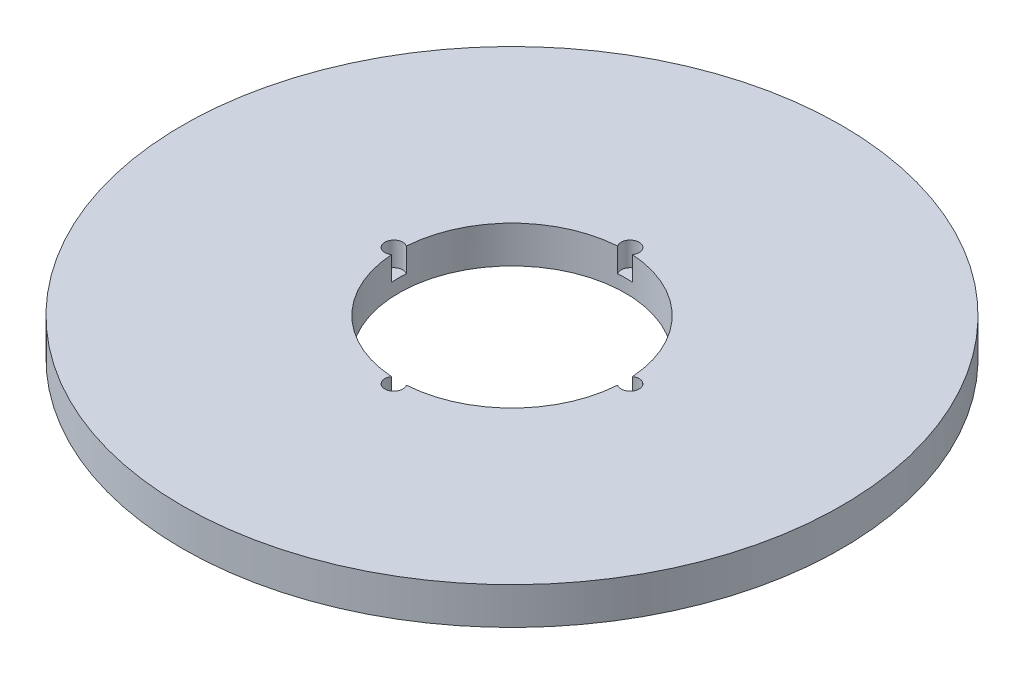
ISO-10303-21;
HEADER;
FILE_DESCRIPTION(('STEP AP214'),'2;1');
FILE_NAME('part.step','',(''),(''),'','','');
FILE_SCHEMA(('AUTOMOTIVE_DESIGN { 1 0 10303 214 1 1 1 1 }'));
ENDSEC;
DATA;
#1=APPLICATION_CONTEXT('core data for automotive mechanical design processes');
#2=APPLICATION_PROTOCOL_DEFINITION('international standard','automotive_design',2000,#1);
#3=PRODUCT_CONTEXT('',#1,'mechanical');
#4=PRODUCT('Part','Part','',(#3));
#5=PRODUCT_RELATED_PRODUCT_CATEGORY('part','',(#4));
#6=PRODUCT_DEFINITION_FORMATION('','',#4);
#7=PRODUCT_DEFINITION_CONTEXT('part definition',#1,'design');
#8=PRODUCT_DEFINITION('design','',#6,#7);
#9=PRODUCT_DEFINITION_SHAPE('','',#8);
#10=(LENGTH_UNIT() NAMED_UNIT(*) SI_UNIT(.MILLI.,.METRE.));
#11=(NAMED_UNIT(*) PLANE_ANGLE_UNIT() SI_UNIT($,.RADIAN.));
#12=(NAMED_UNIT(*) SI_UNIT($,.STERADIAN.) SOLID_ANGLE_UNIT());
#13=UNCERTAINTY_MEASURE_WITH_UNIT(LENGTH_MEASURE(1.E-05),#10,'distance_accuracy_value','');
#14=(GEOMETRIC_REPRESENTATION_CONTEXT(3) GLOBAL_UNCERTAINTY_ASSIGNED_CONTEXT((#13)) GLOBAL_UNIT_ASSIGNED_CONTEXT((#10,
#11,#12)) REPRESENTATION_CONTEXT('',''));
#15=CARTESIAN_POINT('',(0.,0.,0.));
#16=DIRECTION('',(0.,0.,1.));
#17=DIRECTION('',(1.,0.,0.));
#18=AXIS2_PLACEMENT_3D('',#15,#16,#17);
#19=CARTESIAN_POINT('',(0.,9.,0.));
#20=DIRECTION('',(0.,-1.,0.));
#21=DIRECTION('',(0.,0.,-1.));
#22=AXIS2_PLACEMENT_3D('',#19,#20,#21);
#23=CYLINDRICAL_SURFACE('',#22,80.);
#24=CARTESIAN_POINT('',(0.,9.,0.));
#25=DIRECTION('',(0.,1.,0.));
#26=DIRECTION('',(0.,0.,1.));
#27=AXIS2_PLACEMENT_3D('',#24,#25,#26);
#28=CIRCLE('',#27,80.);
#29=CARTESIAN_POINT('',(0.,9.,80.));
#30=VERTEX_POINT('',#29);
#31=EDGE_CURVE('E145',#30,#30,#28,.T.);
#32=ORIENTED_EDGE('',*,*,#31,.F.);
#33=EDGE_LOOP('',(#32));
#34=FACE_BOUND('',#33,.T.);
#35=CARTESIAN_POINT('',(0.,0.,0.));
#36=DIRECTION('',(0.,1.,0.));
#37=DIRECTION('',(0.,0.,1.));
#38=AXIS2_PLACEMENT_3D('',#35,#36,#37);
#39=CIRCLE('',#38,80.);
#40=CARTESIAN_POINT('',(0.,0.,80.));
#41=VERTEX_POINT('',#40);
#42=EDGE_CURVE('E143',#41,#41,#39,.T.);
#43=ORIENTED_EDGE('',*,*,#42,.T.);
#44=EDGE_LOOP('',(#43));
#45=FACE_BOUND('',#44,.T.);
#46=ADVANCED_FACE('F39',(#34,#45),#23,.T.);
#47=CARTESIAN_POINT('',(0.,9.,0.));
#48=DIRECTION('',(0.,1.,0.));
#49=DIRECTION('',(0.,0.,1.));
#50=AXIS2_PLACEMENT_3D('',#47,#48,#49);
#51=PLANE('',#50);
#52=CARTESIAN_POINT('',(1.00161033737131E-13,9.,28.6872602247155));
#53=DIRECTION('',(0.,1.,0.));
#54=DIRECTION('',(1.,0.,0.));
#55=AXIS2_PLACEMENT_3D('',#52,#53,#54);
#56=CIRCLE('',#55,2.18087262641487);
#57=CARTESIAN_POINT('',(-1.79017094720718,9.,27.4416706484823));
#58=VERTEX_POINT('',#57);
#59=CARTESIAN_POINT('',(1.79017094720737,9.,27.4416706484823));
#60=VERTEX_POINT('',#59);
#61=EDGE_CURVE('E152',#58,#60,#56,.T.);
#62=ORIENTED_EDGE('',*,*,#61,.F.);
#63=CARTESIAN_POINT('',(0.,9.,0.));
#64=DIRECTION('',(0.,1.,0.));
#65=DIRECTION('',(0.,0.,1.));
#66=AXIS2_PLACEMENT_3D('',#63,#64,#65);
#67=CIRCLE('',#66,27.5);
#68=CARTESIAN_POINT('',(-27.4416706484823,9.,1.79017094720727));
#69=VERTEX_POINT('',#68);
#70=EDGE_CURVE('E133',#69,#58,#67,.T.);
#71=ORIENTED_EDGE('',*,*,#70,.F.);
#72=CARTESIAN_POINT('',(-28.6872602247155,9.,0.));
#73=DIRECTION('',(0.,1.,0.));
#74=DIRECTION('',(0.,0.,1.));
#75=AXIS2_PLACEMENT_3D('',#72,#73,#74);
#76=CIRCLE('',#75,2.18087262641487);
#77=CARTESIAN_POINT('',(-27.4416706484823,9.,-1.79017094720727));
#78=VERTEX_POINT('',#77);
#79=EDGE_CURVE('E128',#78,#69,#76,.T.);
#80=ORIENTED_EDGE('',*,*,#79,.F.);
#81=CARTESIAN_POINT('',(-1.79017094720756,9.,-27.4416706484823));
#82=VERTEX_POINT('',#81);
#83=EDGE_CURVE('E121',#82,#78,#67,.T.);
#84=ORIENTED_EDGE('',*,*,#83,.F.);
#85=CARTESIAN_POINT('',(-3.00483101211393E-13,9.,-28.6872602247155));
#86=DIRECTION('',(0.,1.,0.));
#87=DIRECTION('',(-1.,0.,0.));
#88=AXIS2_PLACEMENT_3D('',#85,#86,#87);
#89=CIRCLE('',#88,2.18087262641487);
#90=CARTESIAN_POINT('',(1.79017094720698,9.,-27.4416706484823));
#91=VERTEX_POINT('',#90);
#92=EDGE_CURVE('E105',#91,#82,#89,.T.);
#93=ORIENTED_EDGE('',*,*,#92,.F.);
#94=CARTESIAN_POINT('',(27.4416706484823,9.,-1.79017094720727));
#95=VERTEX_POINT('',#94);
#96=EDGE_CURVE('E131',#95,#91,#67,.T.);
#97=ORIENTED_EDGE('',*,*,#96,.F.);
#98=CARTESIAN_POINT('',(28.6872602247155,9.,0.));
#99=DIRECTION('',(0.,1.,0.));
#100=DIRECTION('',(0.,0.,-1.));
#101=AXIS2_PLACEMENT_3D('',#98,#99,#100);
#102=CIRCLE('',#101,2.18087262641487);
#103=CARTESIAN_POINT('',(27.4416706484823,9.,1.79017094720727));
#104=VERTEX_POINT('',#103);
#105=EDGE_CURVE('E154',#104,#95,#102,.T.);
#106=ORIENTED_EDGE('',*,*,#105,.F.);
#107=EDGE_CURVE('E134',#60,#104,#67,.T.);
#108=ORIENTED_EDGE('',*,*,#107,.F.);
#109=EDGE_LOOP('',(#62,#71,#80,#84,#93,#97,#106,#108));
#110=FACE_BOUND('',#109,.T.);
#111=ORIENTED_EDGE('',*,*,#31,.T.);
#112=EDGE_LOOP('',(#111));
#113=FACE_BOUND('',#112,.T.);
#114=ADVANCED_FACE('F130',(#110,#113),#51,.T.);
#115=CARTESIAN_POINT('',(0.,0.,0.));
#116=DIRECTION('',(0.,1.,0.));
#117=DIRECTION('',(0.,0.,1.));
#118=AXIS2_PLACEMENT_3D('',#115,#116,#117);
#119=PLANE('',#118);
#120=CARTESIAN_POINT('',(0.,0.,0.));
#121=DIRECTION('',(0.,1.,0.));
#122=DIRECTION('',(0.,0.,1.));
#123=AXIS2_PLACEMENT_3D('',#120,#121,#122);
#124=CIRCLE('',#123,27.5);
#125=CARTESIAN_POINT('',(0.,0.,27.5));
#126=VERTEX_POINT('',#125);
#127=EDGE_CURVE('E135',#126,#126,#124,.T.);
#128=ORIENTED_EDGE('',*,*,#127,.T.);
#129=EDGE_LOOP('',(#128));
#130=FACE_BOUND('',#129,.T.);
#131=ORIENTED_EDGE('',*,*,#42,.F.);
#132=EDGE_LOOP('',(#131));
#133=FACE_BOUND('',#132,.T.);
#134=ADVANCED_FACE('F195',(#130,#133),#119,.F.);
#135=CARTESIAN_POINT('',(0.,9.,0.));
#136=DIRECTION('',(0.,-1.,0.));
#137=DIRECTION('',(0.,0.,-1.));
#138=AXIS2_PLACEMENT_3D('',#135,#136,#137);
#139=CYLINDRICAL_SURFACE('',#138,27.5);
#140=DIRECTION('',(0.,1.,0.));
#141=VECTOR('',#140,1.);
#142=CARTESIAN_POINT('',(-1.79017094720717,6.0909421968637,27.4416706484823));
#143=LINE('',#142,#141);
#144=CARTESIAN_POINT('',(-1.79017094720718,3.18188439372741,27.4416706484823));
#145=VERTEX_POINT('',#144);
#146=EDGE_CURVE('E11',#145,#58,#143,.T.);
#147=ORIENTED_EDGE('',*,*,#146,.F.);
#148=CARTESIAN_POINT('',(0.,3.18188439372741,0.));
#149=DIRECTION('',(0.,1.,0.));
#150=DIRECTION('',(0.,0.,1.));
#151=AXIS2_PLACEMENT_3D('',#148,#149,#150);
#152=CIRCLE('',#151,27.5);
#153=CARTESIAN_POINT('',(1.79017094720737,3.18188439372741,27.4416706484823));
#154=VERTEX_POINT('',#153);
#155=EDGE_CURVE('E169',#145,#154,#152,.T.);
#156=ORIENTED_EDGE('',*,*,#155,.T.);
#157=DIRECTION('',(0.,1.,0.));
#158=VECTOR('',#157,1.);
#159=CARTESIAN_POINT('',(1.79017094720736,6.0909421968637,27.4416706484823));
#160=LINE('',#159,#158);
#161=EDGE_CURVE('E46',#60,#154,#160,.F.);
#162=ORIENTED_EDGE('',*,*,#161,.F.);
#163=ORIENTED_EDGE('',*,*,#107,.T.);
#164=DIRECTION('',(0.,1.,0.));
#165=VECTOR('',#164,1.);
#166=CARTESIAN_POINT('',(27.4416706484823,6.0909421968637,1.79017094720727));
#167=LINE('',#166,#165);
#168=CARTESIAN_POINT('',(27.4416706484823,3.18188439372741,1.79017094720727));
#169=VERTEX_POINT('',#168);
#170=EDGE_CURVE('E151',#169,#104,#167,.T.);
#171=ORIENTED_EDGE('',*,*,#170,.F.);
#172=CARTESIAN_POINT('',(0.,3.18188439372741,0.));
#173=DIRECTION('',(0.,1.,0.));
#174=DIRECTION('',(0.,0.,1.));
#175=AXIS2_PLACEMENT_3D('',#172,#173,#174);
#176=CIRCLE('',#175,27.5);
#177=CARTESIAN_POINT('',(27.4416706484823,3.18188439372741,-1.79017094720727));
#178=VERTEX_POINT('',#177);
#179=EDGE_CURVE('E173',#169,#178,#176,.T.);
#180=ORIENTED_EDGE('',*,*,#179,.T.);
#181=DIRECTION('',(0.,1.,0.));
#182=VECTOR('',#181,1.);
#183=CARTESIAN_POINT('',(27.4416706484823,6.0909421968637,-1.79017094720727));
#184=LINE('',#183,#182);
#185=EDGE_CURVE('E168',#95,#178,#184,.F.);
#186=ORIENTED_EDGE('',*,*,#185,.F.);
#187=ORIENTED_EDGE('',*,*,#96,.T.);
#188=DIRECTION('',(0.,1.,0.));
#189=VECTOR('',#188,1.);
#190=CARTESIAN_POINT('',(1.79017094720698,6.0909421968637,-27.4416706484823));
#191=LINE('',#190,#189);
#192=CARTESIAN_POINT('',(1.79017094720698,3.18188439372741,-27.4416706484823));
#193=VERTEX_POINT('',#192);
#194=EDGE_CURVE('E108',#193,#91,#191,.T.);
#195=ORIENTED_EDGE('',*,*,#194,.F.);
#196=CARTESIAN_POINT('',(0.,3.18188439372741,0.));
#197=DIRECTION('',(0.,1.,0.));
#198=DIRECTION('',(0.,0.,1.));
#199=AXIS2_PLACEMENT_3D('',#196,#197,#198);
#200=CIRCLE('',#199,27.5);
#201=CARTESIAN_POINT('',(-1.79017094720756,3.18188439372741,-27.4416706484823));
#202=VERTEX_POINT('',#201);
#203=EDGE_CURVE('E122',#193,#202,#200,.T.);
#204=ORIENTED_EDGE('',*,*,#203,.T.);
#205=DIRECTION('',(0.,1.,0.));
#206=VECTOR('',#205,1.);
#207=CARTESIAN_POINT('',(-1.79017094720756,6.0909421968637,-27.4416706484823));
#208=LINE('',#207,#206);
#209=EDGE_CURVE('E106',#82,#202,#208,.F.);
#210=ORIENTED_EDGE('',*,*,#209,.F.);
#211=ORIENTED_EDGE('',*,*,#83,.T.);
#212=DIRECTION('',(0.,1.,0.));
#213=VECTOR('',#212,1.);
#214=CARTESIAN_POINT('',(-27.4416706484823,6.0909421968637,-1.79017094720727));
#215=LINE('',#214,#213);
#216=CARTESIAN_POINT('',(-27.4416706484823,3.18188439372741,-1.79017094720727));
#217=VERTEX_POINT('',#216);
#218=EDGE_CURVE('E177',#217,#78,#215,.T.);
#219=ORIENTED_EDGE('',*,*,#218,.F.);
#220=CARTESIAN_POINT('',(0.,3.18188439372741,0.));
#221=DIRECTION('',(0.,1.,0.));
#222=DIRECTION('',(0.,0.,1.));
#223=AXIS2_PLACEMENT_3D('',#220,#221,#222);
#224=CIRCLE('',#223,27.5);
#225=CARTESIAN_POINT('',(-27.4416706484823,3.18188439372741,1.79017094720727));
#226=VERTEX_POINT('',#225);
#227=EDGE_CURVE('E185',#217,#226,#224,.T.);
#228=ORIENTED_EDGE('',*,*,#227,.T.);
#229=DIRECTION('',(0.,1.,0.));
#230=VECTOR('',#229,1.);
#231=CARTESIAN_POINT('',(-27.4416706484823,6.0909421968637,1.79017094720727));
#232=LINE('',#231,#230);
#233=EDGE_CURVE('E179',#69,#226,#232,.F.);
#234=ORIENTED_EDGE('',*,*,#233,.F.);
#235=ORIENTED_EDGE('',*,*,#70,.T.);
#236=EDGE_LOOP('',(#147,#156,#162,#163,#171,#180,#186,#187,#195,#204,#210,#211,#219,#228,#234,#235));
#237=FACE_BOUND('',#236,.T.);
#238=ORIENTED_EDGE('',*,*,#127,.F.);
#239=EDGE_LOOP('',(#238));
#240=FACE_BOUND('',#239,.T.);
#241=ADVANCED_FACE('F117',(#237,#240),#139,.F.);
#242=CARTESIAN_POINT('',(-28.6872602247155,3.18188439372741,0.));
#243=DIRECTION('',(0.,1.,0.));
#244=DIRECTION('',(0.,0.,1.));
#245=AXIS2_PLACEMENT_3D('',#242,#243,#244);
#246=CYLINDRICAL_SURFACE('',#245,2.18087262641487);
#247=ORIENTED_EDGE('',*,*,#218,.T.);
#248=ORIENTED_EDGE('',*,*,#79,.T.);
#249=ORIENTED_EDGE('',*,*,#233,.T.);
#250=CARTESIAN_POINT('',(-28.6872602247155,3.18188439372741,0.));
#251=DIRECTION('',(0.,1.,0.));
#252=DIRECTION('',(0.,0.,1.));
#253=AXIS2_PLACEMENT_3D('',#250,#251,#252);
#254=CIRCLE('',#253,2.18087262641487);
#255=EDGE_CURVE('E140',#217,#226,#254,.T.);
#256=ORIENTED_EDGE('',*,*,#255,.F.);
#257=EDGE_LOOP('',(#247,#248,#249,#256));
#258=FACE_BOUND('',#257,.T.);
#259=ADVANCED_FACE('F200',(#258),#246,.F.);
#260=CARTESIAN_POINT('',(-28.6872602247155,3.18188439372741,0.));
#261=DIRECTION('',(0.,1.,0.));
#262=DIRECTION('',(0.,0.,1.));
#263=AXIS2_PLACEMENT_3D('',#260,#261,#262);
#264=PLANE('',#263);
#265=ORIENTED_EDGE('',*,*,#255,.T.);
#266=ORIENTED_EDGE('',*,*,#227,.F.);
#267=EDGE_LOOP('',(#265,#266));
#268=FACE_BOUND('',#267,.T.);
#269=ADVANCED_FACE('F202',(#268),#264,.T.);
#270=CARTESIAN_POINT('',(-3.00483101211393E-13,3.18188439372741,-28.6872602247155));
#271=DIRECTION('',(0.,1.,0.));
#272=DIRECTION('',(0.,0.,1.));
#273=AXIS2_PLACEMENT_3D('',#270,#271,#272);
#274=CYLINDRICAL_SURFACE('',#273,2.18087262641487);
#275=ORIENTED_EDGE('',*,*,#194,.T.);
#276=ORIENTED_EDGE('',*,*,#92,.T.);
#277=ORIENTED_EDGE('',*,*,#209,.T.);
#278=CARTESIAN_POINT('',(-3.00483101211393E-13,3.18188439372741,-28.6872602247155));
#279=DIRECTION('',(0.,1.,0.));
#280=DIRECTION('',(-1.,0.,0.));
#281=AXIS2_PLACEMENT_3D('',#278,#279,#280);
#282=CIRCLE('',#281,2.18087262641487);
#283=EDGE_CURVE('E111',#193,#202,#282,.T.);
#284=ORIENTED_EDGE('',*,*,#283,.F.);
#285=EDGE_LOOP('',(#275,#276,#277,#284));
#286=FACE_BOUND('',#285,.T.);
#287=ADVANCED_FACE('F102',(#286),#274,.F.);
#288=CARTESIAN_POINT('',(-3.00483101211393E-13,3.18188439372741,-28.6872602247155));
#289=DIRECTION('',(0.,1.,0.));
#290=DIRECTION('',(-1.,0.,0.));
#291=AXIS2_PLACEMENT_3D('',#288,#289,#290);
#292=PLANE('',#291);
#293=ORIENTED_EDGE('',*,*,#283,.T.);
#294=ORIENTED_EDGE('',*,*,#203,.F.);
#295=EDGE_LOOP('',(#293,#294));
#296=FACE_BOUND('',#295,.T.);
#297=ADVANCED_FACE('F211',(#296),#292,.T.);
#298=CARTESIAN_POINT('',(28.6872602247155,3.18188439372741,0.));
#299=DIRECTION('',(0.,1.,0.));
#300=DIRECTION('',(0.,0.,1.));
#301=AXIS2_PLACEMENT_3D('',#298,#299,#300);
#302=CYLINDRICAL_SURFACE('',#301,2.18087262641487);
#303=ORIENTED_EDGE('',*,*,#170,.T.);
#304=ORIENTED_EDGE('',*,*,#105,.T.);
#305=ORIENTED_EDGE('',*,*,#185,.T.);
#306=CARTESIAN_POINT('',(28.6872602247155,3.18188439372741,0.));
#307=DIRECTION('',(0.,1.,0.));
#308=DIRECTION('',(0.,0.,-1.));
#309=AXIS2_PLACEMENT_3D('',#306,#307,#308);
#310=CIRCLE('',#309,2.18087262641487);
#311=EDGE_CURVE('E56',#169,#178,#310,.T.);
#312=ORIENTED_EDGE('',*,*,#311,.F.);
#313=EDGE_LOOP('',(#303,#304,#305,#312));
#314=FACE_BOUND('',#313,.T.);
#315=ADVANCED_FACE('F212',(#314),#302,.F.);
#316=CARTESIAN_POINT('',(28.6872602247155,3.18188439372741,0.));
#317=DIRECTION('',(0.,1.,0.));
#318=DIRECTION('',(0.,0.,-1.));
#319=AXIS2_PLACEMENT_3D('',#316,#317,#318);
#320=PLANE('',#319);
#321=ORIENTED_EDGE('',*,*,#311,.T.);
#322=ORIENTED_EDGE('',*,*,#179,.F.);
#323=EDGE_LOOP('',(#321,#322));
#324=FACE_BOUND('',#323,.T.);
#325=ADVANCED_FACE('F217',(#324),#320,.T.);
#326=CARTESIAN_POINT('',(1.00161033737131E-13,3.18188439372741,28.6872602247155));
#327=DIRECTION('',(0.,1.,0.));
#328=DIRECTION('',(0.,0.,1.));
#329=AXIS2_PLACEMENT_3D('',#326,#327,#328);
#330=CYLINDRICAL_SURFACE('',#329,2.18087262641487);
#331=ORIENTED_EDGE('',*,*,#146,.T.);
#332=ORIENTED_EDGE('',*,*,#61,.T.);
#333=ORIENTED_EDGE('',*,*,#161,.T.);
#334=CARTESIAN_POINT('',(1.00161033737131E-13,3.18188439372741,28.6872602247155));
#335=DIRECTION('',(0.,1.,0.));
#336=DIRECTION('',(1.,0.,0.));
#337=AXIS2_PLACEMENT_3D('',#334,#335,#336);
#338=CIRCLE('',#337,2.18087262641487);
#339=EDGE_CURVE('E55',#145,#154,#338,.T.);
#340=ORIENTED_EDGE('',*,*,#339,.F.);
#341=EDGE_LOOP('',(#331,#332,#333,#340));
#342=FACE_BOUND('',#341,.T.);
#343=ADVANCED_FACE('F170',(#342),#330,.F.);
#344=CARTESIAN_POINT('',(1.00161033737131E-13,3.18188439372741,28.6872602247155));
#345=DIRECTION('',(0.,1.,0.));
#346=DIRECTION('',(1.,0.,0.));
#347=AXIS2_PLACEMENT_3D('',#344,#345,#346);
#348=PLANE('',#347);
#349=ORIENTED_EDGE('',*,*,#339,.T.);
#350=ORIENTED_EDGE('',*,*,#155,.F.);
#351=EDGE_LOOP('',(#349,#350));
#352=FACE_BOUND('',#351,.T.);
#353=ADVANCED_FACE('F224',(#352),#348,.T.);
#354=CLOSED_SHELL('',(#46,#114,#134,#241,#259,#269,#287,#297,#315,#325,#343,#353));
#355=MANIFOLD_SOLID_BREP('B2',#354);
#356=ADVANCED_BREP_SHAPE_REPRESENTATION('',(#18,#355),#14);
#357=SHAPE_DEFINITION_REPRESENTATION(#9,#356);
ENDSEC;
END-ISO-10303-21;
